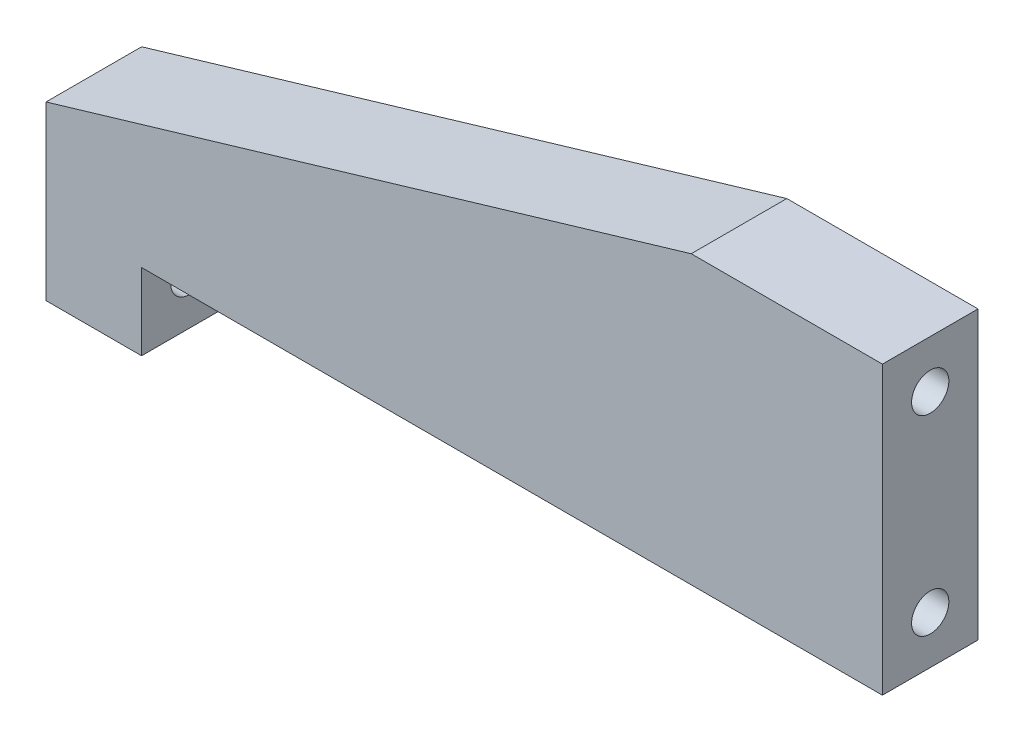
ISO-10303-21;
HEADER;
FILE_DESCRIPTION(('STEP AP214'),'2;1');
FILE_NAME('part.step','',(''),(''),'','','');
FILE_SCHEMA(('AUTOMOTIVE_DESIGN { 1 0 10303 214 1 1 1 1 }'));
ENDSEC;
DATA;
#1=APPLICATION_CONTEXT('core data for automotive mechanical design processes');
#2=APPLICATION_PROTOCOL_DEFINITION('international standard','automotive_design',2000,#1);
#3=PRODUCT_CONTEXT('',#1,'mechanical');
#4=PRODUCT('Part','Part','',(#3));
#5=PRODUCT_RELATED_PRODUCT_CATEGORY('part','',(#4));
#6=PRODUCT_DEFINITION_FORMATION('','',#4);
#7=PRODUCT_DEFINITION_CONTEXT('part definition',#1,'design');
#8=PRODUCT_DEFINITION('design','',#6,#7);
#9=PRODUCT_DEFINITION_SHAPE('','',#8);
#10=(LENGTH_UNIT() NAMED_UNIT(*) SI_UNIT(.MILLI.,.METRE.));
#11=(NAMED_UNIT(*) PLANE_ANGLE_UNIT() SI_UNIT($,.RADIAN.));
#12=(NAMED_UNIT(*) SI_UNIT($,.STERADIAN.) SOLID_ANGLE_UNIT());
#13=UNCERTAINTY_MEASURE_WITH_UNIT(LENGTH_MEASURE(1.E-05),#10,'distance_accuracy_value','');
#14=(GEOMETRIC_REPRESENTATION_CONTEXT(3) GLOBAL_UNCERTAINTY_ASSIGNED_CONTEXT((#13)) GLOBAL_UNIT_ASSIGNED_CONTEXT((#10,
#11,#12)) REPRESENTATION_CONTEXT('',''));
#15=CARTESIAN_POINT('',(0.,0.,0.));
#16=DIRECTION('',(0.,0.,1.));
#17=DIRECTION('',(1.,0.,0.));
#18=AXIS2_PLACEMENT_3D('',#15,#16,#17);
#19=CARTESIAN_POINT('',(-43.75,-15.,10.));
#20=DIRECTION('',(0.,1.,0.));
#21=DIRECTION('',(0.,0.,1.));
#22=AXIS2_PLACEMENT_3D('',#19,#20,#21);
#23=PLANE('',#22);
#24=DIRECTION('',(1.,0.,0.));
#25=VECTOR('',#24,1.);
#26=CARTESIAN_POINT('',(-43.75,-15.,10.));
#27=LINE('',#26,#25);
#28=CARTESIAN_POINT('',(-33.75,-15.,10.));
#29=VERTEX_POINT('',#28);
#30=CARTESIAN_POINT('',(43.75,-15.,10.));
#31=VERTEX_POINT('',#30);
#32=EDGE_CURVE('E83',#29,#31,#27,.T.);
#33=ORIENTED_EDGE('',*,*,#32,.F.);
#34=DIRECTION('',(0.,0.,-1.));
#35=VECTOR('',#34,1.);
#36=CARTESIAN_POINT('',(-33.75,-15.,22.8062484748657));
#37=LINE('',#36,#35);
#38=CARTESIAN_POINT('',(-33.75,-15.,0.));
#39=VERTEX_POINT('',#38);
#40=EDGE_CURVE('E96',#29,#39,#37,.T.);
#41=ORIENTED_EDGE('',*,*,#40,.T.);
#42=DIRECTION('',(1.,0.,0.));
#43=VECTOR('',#42,1.);
#44=CARTESIAN_POINT('',(-43.75,-15.,0.));
#45=LINE('',#44,#43);
#46=CARTESIAN_POINT('',(43.75,-15.,0.));
#47=VERTEX_POINT('',#46);
#48=EDGE_CURVE('E119',#39,#47,#45,.T.);
#49=ORIENTED_EDGE('',*,*,#48,.T.);
#50=DIRECTION('',(0.,0.,-1.));
#51=VECTOR('',#50,1.);
#52=CARTESIAN_POINT('',(43.75,-15.,10.));
#53=LINE('',#52,#51);
#54=EDGE_CURVE('E11',#31,#47,#53,.T.);
#55=ORIENTED_EDGE('',*,*,#54,.F.);
#56=EDGE_LOOP('',(#33,#41,#49,#55));
#57=FACE_BOUND('',#56,.T.);
#58=ADVANCED_FACE('F30',(#57),#23,.F.);
#59=CARTESIAN_POINT('',(43.75,-15.,10.));
#60=DIRECTION('',(-1.,0.,0.));
#61=DIRECTION('',(0.,0.,1.));
#62=AXIS2_PLACEMENT_3D('',#59,#60,#61);
#63=PLANE('',#62);
#64=CARTESIAN_POINT('',(43.75,-9.99999999999999,5.));
#65=DIRECTION('',(1.,0.,0.));
#66=DIRECTION('',(0.,0.,-1.));
#67=AXIS2_PLACEMENT_3D('',#64,#65,#66);
#68=CIRCLE('',#67,1.95);
#69=CARTESIAN_POINT('',(43.75,-9.99999999999999,3.05));
#70=VERTEX_POINT('',#69);
#71=EDGE_CURVE('E181',#70,#70,#68,.T.);
#72=ORIENTED_EDGE('',*,*,#71,.F.);
#73=EDGE_LOOP('',(#72));
#74=FACE_BOUND('',#73,.T.);
#75=CARTESIAN_POINT('',(43.75,10.,5.));
#76=DIRECTION('',(1.,0.,0.));
#77=DIRECTION('',(0.,0.,-1.));
#78=AXIS2_PLACEMENT_3D('',#75,#76,#77);
#79=CIRCLE('',#78,1.95);
#80=CARTESIAN_POINT('',(43.75,10.,3.05));
#81=VERTEX_POINT('',#80);
#82=EDGE_CURVE('E186',#81,#81,#79,.T.);
#83=ORIENTED_EDGE('',*,*,#82,.F.);
#84=EDGE_LOOP('',(#83));
#85=FACE_BOUND('',#84,.T.);
#86=DIRECTION('',(0.,1.,0.));
#87=VECTOR('',#86,1.);
#88=CARTESIAN_POINT('',(43.75,-15.,0.));
#89=LINE('',#88,#87);
#90=CARTESIAN_POINT('',(43.75,15.,0.));
#91=VERTEX_POINT('',#90);
#92=EDGE_CURVE('E133',#47,#91,#89,.T.);
#93=ORIENTED_EDGE('',*,*,#92,.T.);
#94=DIRECTION('',(0.,0.,-1.));
#95=VECTOR('',#94,1.);
#96=CARTESIAN_POINT('',(43.75,15.,10.));
#97=LINE('',#96,#95);
#98=CARTESIAN_POINT('',(43.75,15.,10.));
#99=VERTEX_POINT('',#98);
#100=EDGE_CURVE('E38',#99,#91,#97,.T.);
#101=ORIENTED_EDGE('',*,*,#100,.F.);
#102=DIRECTION('',(0.,1.,0.));
#103=VECTOR('',#102,1.);
#104=CARTESIAN_POINT('',(43.75,-15.,10.));
#105=LINE('',#104,#103);
#106=EDGE_CURVE('E110',#31,#99,#105,.T.);
#107=ORIENTED_EDGE('',*,*,#106,.F.);
#108=ORIENTED_EDGE('',*,*,#54,.T.);
#109=EDGE_LOOP('',(#93,#101,#107,#108));
#110=FACE_BOUND('',#109,.T.);
#111=ADVANCED_FACE('F208',(#74,#85,#110),#63,.F.);
#112=CARTESIAN_POINT('',(23.75,15.,10.));
#113=DIRECTION('',(0.,-1.,0.));
#114=DIRECTION('',(1.,0.,0.));
#115=AXIS2_PLACEMENT_3D('',#112,#113,#114);
#116=PLANE('',#115);
#117=DIRECTION('',(-1.,0.,0.));
#118=VECTOR('',#117,1.);
#119=CARTESIAN_POINT('',(23.75,15.,0.));
#120=LINE('',#119,#118);
#121=CARTESIAN_POINT('',(23.75,15.,0.));
#122=VERTEX_POINT('',#121);
#123=EDGE_CURVE('E135',#91,#122,#120,.T.);
#124=ORIENTED_EDGE('',*,*,#123,.T.);
#125=DIRECTION('',(0.,0.,-1.));
#126=VECTOR('',#125,1.);
#127=CARTESIAN_POINT('',(23.75,15.,10.));
#128=LINE('',#127,#126);
#129=CARTESIAN_POINT('',(23.75,15.,10.));
#130=VERTEX_POINT('',#129);
#131=EDGE_CURVE('E139',#130,#122,#128,.T.);
#132=ORIENTED_EDGE('',*,*,#131,.F.);
#133=DIRECTION('',(-1.,0.,0.));
#134=VECTOR('',#133,1.);
#135=CARTESIAN_POINT('',(23.75,15.,10.));
#136=LINE('',#135,#134);
#137=EDGE_CURVE('E113',#99,#130,#136,.T.);
#138=ORIENTED_EDGE('',*,*,#137,.F.);
#139=ORIENTED_EDGE('',*,*,#100,.T.);
#140=EDGE_LOOP('',(#124,#132,#138,#139));
#141=FACE_BOUND('',#140,.T.);
#142=ADVANCED_FACE('F146',(#141),#116,.F.);
#143=CARTESIAN_POINT('',(-43.75,-5.,10.));
#144=DIRECTION('',(0.284088329691374,-0.958798112708387,0.));
#145=DIRECTION('',(0.958798112708387,0.284088329691374,0.));
#146=AXIS2_PLACEMENT_3D('',#143,#144,#145);
#147=PLANE('',#146);
#148=DIRECTION('',(-0.958798112708387,-0.284088329691374,0.));
#149=VECTOR('',#148,1.);
#150=CARTESIAN_POINT('',(-43.75,-5.,0.));
#151=LINE('',#150,#149);
#152=CARTESIAN_POINT('',(-43.75,-5.,0.));
#153=VERTEX_POINT('',#152);
#154=EDGE_CURVE('E76',#122,#153,#151,.T.);
#155=ORIENTED_EDGE('',*,*,#154,.T.);
#156=DIRECTION('',(0.,0.,-1.));
#157=VECTOR('',#156,1.);
#158=CARTESIAN_POINT('',(-43.75,-5.,10.));
#159=LINE('',#158,#157);
#160=CARTESIAN_POINT('',(-43.75,-5.,10.));
#161=VERTEX_POINT('',#160);
#162=EDGE_CURVE('E130',#161,#153,#159,.T.);
#163=ORIENTED_EDGE('',*,*,#162,.F.);
#164=DIRECTION('',(-0.958798112708387,-0.284088329691374,0.));
#165=VECTOR('',#164,1.);
#166=CARTESIAN_POINT('',(-43.75,-5.,10.));
#167=LINE('',#166,#165);
#168=EDGE_CURVE('E55',#130,#161,#167,.T.);
#169=ORIENTED_EDGE('',*,*,#168,.F.);
#170=ORIENTED_EDGE('',*,*,#131,.T.);
#171=EDGE_LOOP('',(#155,#163,#169,#170));
#172=FACE_BOUND('',#171,.T.);
#173=ADVANCED_FACE('F216',(#172),#147,.F.);
#174=CARTESIAN_POINT('',(-43.75,-15.,10.));
#175=DIRECTION('',(1.,0.,0.));
#176=DIRECTION('',(0.,0.,-1.));
#177=AXIS2_PLACEMENT_3D('',#174,#175,#176);
#178=PLANE('',#177);
#179=CARTESIAN_POINT('',(-43.75,-18.,5.));
#180=DIRECTION('',(-1.,0.,0.));
#181=DIRECTION('',(0.,0.,1.));
#182=AXIS2_PLACEMENT_3D('',#179,#180,#181);
#183=CIRCLE('',#182,1.95);
#184=CARTESIAN_POINT('',(-43.75,-18.,6.95));
#185=VERTEX_POINT('',#184);
#186=EDGE_CURVE('E168',#185,#185,#183,.T.);
#187=ORIENTED_EDGE('',*,*,#186,.F.);
#188=EDGE_LOOP('',(#187));
#189=FACE_BOUND('',#188,.T.);
#190=CARTESIAN_POINT('',(-43.75,-9.99999999999999,5.));
#191=DIRECTION('',(-1.,0.,0.));
#192=DIRECTION('',(0.,0.,1.));
#193=AXIS2_PLACEMENT_3D('',#190,#191,#192);
#194=CIRCLE('',#193,1.95);
#195=CARTESIAN_POINT('',(-43.75,-9.99999999999999,6.95));
#196=VERTEX_POINT('',#195);
#197=EDGE_CURVE('E107',#196,#196,#194,.T.);
#198=ORIENTED_EDGE('',*,*,#197,.F.);
#199=EDGE_LOOP('',(#198));
#200=FACE_BOUND('',#199,.T.);
#201=DIRECTION('',(0.,-1.,0.));
#202=VECTOR('',#201,1.);
#203=CARTESIAN_POINT('',(-43.75,-15.,0.));
#204=LINE('',#203,#202);
#205=CARTESIAN_POINT('',(-43.75,-23.,0.));
#206=VERTEX_POINT('',#205);
#207=EDGE_CURVE('E111',#153,#206,#204,.T.);
#208=ORIENTED_EDGE('',*,*,#207,.T.);
#209=DIRECTION('',(0.,0.,-1.));
#210=VECTOR('',#209,1.);
#211=CARTESIAN_POINT('',(-43.75,-23.,22.8062484748657));
#212=LINE('',#211,#210);
#213=CARTESIAN_POINT('',(-43.75,-23.,10.));
#214=VERTEX_POINT('',#213);
#215=EDGE_CURVE('E161',#214,#206,#212,.T.);
#216=ORIENTED_EDGE('',*,*,#215,.F.);
#217=DIRECTION('',(0.,-1.,0.));
#218=VECTOR('',#217,1.);
#219=CARTESIAN_POINT('',(-43.75,-15.,10.));
#220=LINE('',#219,#218);
#221=EDGE_CURVE('E129',#161,#214,#220,.T.);
#222=ORIENTED_EDGE('',*,*,#221,.F.);
#223=ORIENTED_EDGE('',*,*,#162,.T.);
#224=EDGE_LOOP('',(#208,#216,#222,#223));
#225=FACE_BOUND('',#224,.T.);
#226=ADVANCED_FACE('F159',(#189,#200,#225),#178,.F.);
#227=CARTESIAN_POINT('',(43.75,-15.,10.));
#228=DIRECTION('',(0.,0.,1.));
#229=DIRECTION('',(1.,0.,0.));
#230=AXIS2_PLACEMENT_3D('',#227,#228,#229);
#231=PLANE('',#230);
#232=ORIENTED_EDGE('',*,*,#221,.T.);
#233=DIRECTION('',(1.,0.,0.));
#234=VECTOR('',#233,1.);
#235=CARTESIAN_POINT('',(-43.75,-23.,10.));
#236=LINE('',#235,#234);
#237=CARTESIAN_POINT('',(-33.75,-23.,10.));
#238=VERTEX_POINT('',#237);
#239=EDGE_CURVE('E102',#214,#238,#236,.T.);
#240=ORIENTED_EDGE('',*,*,#239,.T.);
#241=DIRECTION('',(0.,1.,0.));
#242=VECTOR('',#241,1.);
#243=CARTESIAN_POINT('',(-33.75,-15.,10.));
#244=LINE('',#243,#242);
#245=EDGE_CURVE('E98',#238,#29,#244,.T.);
#246=ORIENTED_EDGE('',*,*,#245,.T.);
#247=ORIENTED_EDGE('',*,*,#32,.T.);
#248=ORIENTED_EDGE('',*,*,#106,.T.);
#249=ORIENTED_EDGE('',*,*,#137,.T.);
#250=ORIENTED_EDGE('',*,*,#168,.T.);
#251=EDGE_LOOP('',(#232,#240,#246,#247,#248,#249,#250));
#252=FACE_BOUND('',#251,.T.);
#253=ADVANCED_FACE('F105',(#252),#231,.T.);
#254=CARTESIAN_POINT('',(43.75,-15.,0.));
#255=DIRECTION('',(0.,0.,1.));
#256=DIRECTION('',(1.,0.,0.));
#257=AXIS2_PLACEMENT_3D('',#254,#255,#256);
#258=PLANE('',#257);
#259=ORIENTED_EDGE('',*,*,#48,.F.);
#260=DIRECTION('',(0.,1.,0.));
#261=VECTOR('',#260,1.);
#262=CARTESIAN_POINT('',(-33.75,-15.,0.));
#263=LINE('',#262,#261);
#264=CARTESIAN_POINT('',(-33.75,-23.,0.));
#265=VERTEX_POINT('',#264);
#266=EDGE_CURVE('E46',#265,#39,#263,.T.);
#267=ORIENTED_EDGE('',*,*,#266,.F.);
#268=DIRECTION('',(1.,0.,0.));
#269=VECTOR('',#268,1.);
#270=CARTESIAN_POINT('',(-43.75,-23.,0.));
#271=LINE('',#270,#269);
#272=EDGE_CURVE('E155',#206,#265,#271,.T.);
#273=ORIENTED_EDGE('',*,*,#272,.F.);
#274=ORIENTED_EDGE('',*,*,#207,.F.);
#275=ORIENTED_EDGE('',*,*,#154,.F.);
#276=ORIENTED_EDGE('',*,*,#123,.F.);
#277=ORIENTED_EDGE('',*,*,#92,.F.);
#278=EDGE_LOOP('',(#259,#267,#273,#274,#275,#276,#277));
#279=FACE_BOUND('',#278,.T.);
#280=ADVANCED_FACE('F151',(#279),#258,.F.);
#281=CARTESIAN_POINT('',(28.75,10.,5.));
#282=DIRECTION('',(-1.,0.,0.));
#283=DIRECTION('',(0.,0.,1.));
#284=AXIS2_PLACEMENT_3D('',#281,#282,#283);
#285=PLANE('',#284);
#286=CARTESIAN_POINT('',(28.75,10.,5.));
#287=DIRECTION('',(1.,0.,0.));
#288=DIRECTION('',(0.,0.,-1.));
#289=AXIS2_PLACEMENT_3D('',#286,#287,#288);
#290=CIRCLE('',#289,1.95);
#291=CARTESIAN_POINT('',(28.75,10.,3.05));
#292=VERTEX_POINT('',#291);
#293=EDGE_CURVE('E124',#292,#292,#290,.T.);
#294=ORIENTED_EDGE('',*,*,#293,.T.);
#295=EDGE_LOOP('',(#294));
#296=FACE_BOUND('',#295,.T.);
#297=ADVANCED_FACE('F193',(#296),#285,.F.);
#298=CARTESIAN_POINT('',(43.75,10.,5.));
#299=DIRECTION('',(1.,0.,0.));
#300=DIRECTION('',(0.,0.,-1.));
#301=AXIS2_PLACEMENT_3D('',#298,#299,#300);
#302=CYLINDRICAL_SURFACE('',#301,1.95);
#303=ORIENTED_EDGE('',*,*,#293,.F.);
#304=EDGE_LOOP('',(#303));
#305=FACE_BOUND('',#304,.T.);
#306=ORIENTED_EDGE('',*,*,#82,.T.);
#307=EDGE_LOOP('',(#306));
#308=FACE_BOUND('',#307,.T.);
#309=ADVANCED_FACE('F195',(#305,#308),#302,.F.);
#310=CARTESIAN_POINT('',(28.75,-10.,5.));
#311=DIRECTION('',(-1.,0.,0.));
#312=DIRECTION('',(0.,0.,1.));
#313=AXIS2_PLACEMENT_3D('',#310,#311,#312);
#314=PLANE('',#313);
#315=CARTESIAN_POINT('',(28.75,-9.99999999999999,5.));
#316=DIRECTION('',(1.,0.,0.));
#317=DIRECTION('',(0.,0.,-1.));
#318=AXIS2_PLACEMENT_3D('',#315,#316,#317);
#319=CIRCLE('',#318,1.95);
#320=CARTESIAN_POINT('',(28.75,-9.99999999999999,3.05));
#321=VERTEX_POINT('',#320);
#322=EDGE_CURVE('E184',#321,#321,#319,.T.);
#323=ORIENTED_EDGE('',*,*,#322,.T.);
#324=EDGE_LOOP('',(#323));
#325=FACE_BOUND('',#324,.T.);
#326=ADVANCED_FACE('F197',(#325),#314,.F.);
#327=CARTESIAN_POINT('',(43.75,-9.99999999999999,5.));
#328=DIRECTION('',(1.,0.,0.));
#329=DIRECTION('',(0.,0.,-1.));
#330=AXIS2_PLACEMENT_3D('',#327,#328,#329);
#331=CYLINDRICAL_SURFACE('',#330,1.95);
#332=ORIENTED_EDGE('',*,*,#322,.F.);
#333=EDGE_LOOP('',(#332));
#334=FACE_BOUND('',#333,.T.);
#335=ORIENTED_EDGE('',*,*,#71,.T.);
#336=EDGE_LOOP('',(#335));
#337=FACE_BOUND('',#336,.T.);
#338=ADVANCED_FACE('F203',(#334,#337),#331,.F.);
#339=CARTESIAN_POINT('',(-28.75,-10.,5.));
#340=DIRECTION('',(1.,0.,0.));
#341=DIRECTION('',(0.,0.,-1.));
#342=AXIS2_PLACEMENT_3D('',#339,#340,#341);
#343=PLANE('',#342);
#344=CARTESIAN_POINT('',(-28.75,-9.99999999999999,5.));
#345=DIRECTION('',(-1.,0.,0.));
#346=DIRECTION('',(0.,0.,1.));
#347=AXIS2_PLACEMENT_3D('',#344,#345,#346);
#348=CIRCLE('',#347,1.95);
#349=CARTESIAN_POINT('',(-28.75,-9.99999999999999,6.95));
#350=VERTEX_POINT('',#349);
#351=EDGE_CURVE('E178',#350,#350,#348,.T.);
#352=ORIENTED_EDGE('',*,*,#351,.T.);
#353=EDGE_LOOP('',(#352));
#354=FACE_BOUND('',#353,.T.);
#355=ADVANCED_FACE('F265',(#354),#343,.F.);
#356=CARTESIAN_POINT('',(-43.75,-9.99999999999999,5.));
#357=DIRECTION('',(-1.,0.,0.));
#358=DIRECTION('',(0.,0.,1.));
#359=AXIS2_PLACEMENT_3D('',#356,#357,#358);
#360=CYLINDRICAL_SURFACE('',#359,1.95);
#361=ORIENTED_EDGE('',*,*,#351,.F.);
#362=EDGE_LOOP('',(#361));
#363=FACE_BOUND('',#362,.T.);
#364=ORIENTED_EDGE('',*,*,#197,.T.);
#365=EDGE_LOOP('',(#364));
#366=FACE_BOUND('',#365,.T.);
#367=ADVANCED_FACE('F275',(#363,#366),#360,.F.);
#368=CARTESIAN_POINT('',(-43.75,-23.,22.8062484748657));
#369=DIRECTION('',(0.,1.,0.));
#370=DIRECTION('',(0.,0.,1.));
#371=AXIS2_PLACEMENT_3D('',#368,#369,#370);
#372=PLANE('',#371);
#373=ORIENTED_EDGE('',*,*,#239,.F.);
#374=ORIENTED_EDGE('',*,*,#215,.T.);
#375=ORIENTED_EDGE('',*,*,#272,.T.);
#376=DIRECTION('',(0.,0.,-1.));
#377=VECTOR('',#376,1.);
#378=CARTESIAN_POINT('',(-33.75,-23.,22.8062484748657));
#379=LINE('',#378,#377);
#380=EDGE_CURVE('E165',#238,#265,#379,.T.);
#381=ORIENTED_EDGE('',*,*,#380,.F.);
#382=EDGE_LOOP('',(#373,#374,#375,#381));
#383=FACE_BOUND('',#382,.T.);
#384=ADVANCED_FACE('F163',(#383),#372,.F.);
#385=CARTESIAN_POINT('',(-33.75,-15.,22.8062484748657));
#386=DIRECTION('',(-1.,0.,0.));
#387=DIRECTION('',(0.,0.,1.));
#388=AXIS2_PLACEMENT_3D('',#385,#386,#387);
#389=PLANE('',#388);
#390=CARTESIAN_POINT('',(-33.75,-18.,5.));
#391=DIRECTION('',(-1.,0.,0.));
#392=DIRECTION('',(0.,0.,1.));
#393=AXIS2_PLACEMENT_3D('',#390,#391,#392);
#394=CIRCLE('',#393,1.95);
#395=CARTESIAN_POINT('',(-33.75,-18.,6.95));
#396=VERTEX_POINT('',#395);
#397=EDGE_CURVE('E33',#396,#396,#394,.T.);
#398=ORIENTED_EDGE('',*,*,#397,.T.);
#399=EDGE_LOOP('',(#398));
#400=FACE_BOUND('',#399,.T.);
#401=ORIENTED_EDGE('',*,*,#245,.F.);
#402=ORIENTED_EDGE('',*,*,#380,.T.);
#403=ORIENTED_EDGE('',*,*,#266,.T.);
#404=ORIENTED_EDGE('',*,*,#40,.F.);
#405=EDGE_LOOP('',(#401,#402,#403,#404));
#406=FACE_BOUND('',#405,.T.);
#407=ADVANCED_FACE('F97',(#400,#406),#389,.F.);
#408=CARTESIAN_POINT('',(-43.75,-18.,5.));
#409=DIRECTION('',(-1.,0.,0.));
#410=DIRECTION('',(0.,0.,1.));
#411=AXIS2_PLACEMENT_3D('',#408,#409,#410);
#412=CYLINDRICAL_SURFACE('',#411,1.95);
#413=ORIENTED_EDGE('',*,*,#186,.T.);
#414=EDGE_LOOP('',(#413));
#415=FACE_BOUND('',#414,.T.);
#416=ORIENTED_EDGE('',*,*,#397,.F.);
#417=EDGE_LOOP('',(#416));
#418=FACE_BOUND('',#417,.T.);
#419=ADVANCED_FACE('F331',(#415,#418),#412,.F.);
#420=CLOSED_SHELL('',(#58,#111,#142,#173,#226,#253,#280,#297,#309,#326,#338,#355,#367,#384,#407,#419));
#421=MANIFOLD_SOLID_BREP('B2',#420);
#422=ADVANCED_BREP_SHAPE_REPRESENTATION('',(#18,#421),#14);
#423=SHAPE_DEFINITION_REPRESENTATION(#9,#422);
ENDSEC;
END-ISO-10303-21;
